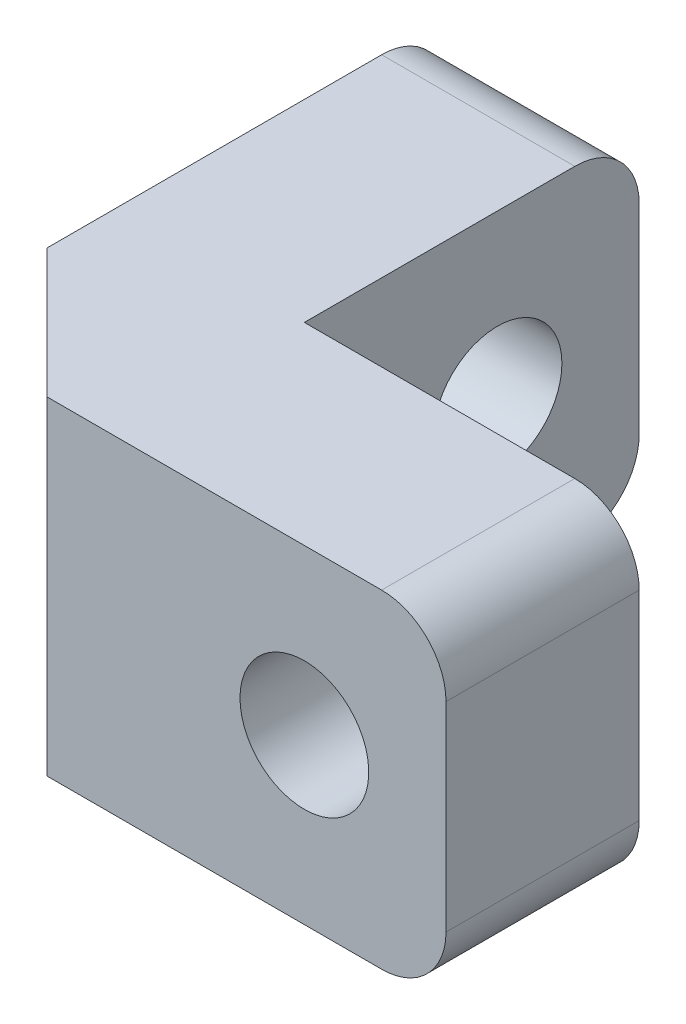
ISO-10303-21;
HEADER;
FILE_DESCRIPTION(('STEP AP214'),'2;1');
FILE_NAME('part.step','',(''),(''),'','','');
FILE_SCHEMA(('AUTOMOTIVE_DESIGN { 1 0 10303 214 1 1 1 1 }'));
ENDSEC;
DATA;
#1=APPLICATION_CONTEXT('core data for automotive mechanical design processes');
#2=APPLICATION_PROTOCOL_DEFINITION('international standard','automotive_design',2000,#1);
#3=PRODUCT_CONTEXT('',#1,'mechanical');
#4=PRODUCT('Part','Part','',(#3));
#5=PRODUCT_RELATED_PRODUCT_CATEGORY('part','',(#4));
#6=PRODUCT_DEFINITION_FORMATION('','',#4);
#7=PRODUCT_DEFINITION_CONTEXT('part definition',#1,'design');
#8=PRODUCT_DEFINITION('design','',#6,#7);
#9=PRODUCT_DEFINITION_SHAPE('','',#8);
#10=(LENGTH_UNIT() NAMED_UNIT(*) SI_UNIT(.MILLI.,.METRE.));
#11=(NAMED_UNIT(*) PLANE_ANGLE_UNIT() SI_UNIT($,.RADIAN.));
#12=(NAMED_UNIT(*) SI_UNIT($,.STERADIAN.) SOLID_ANGLE_UNIT());
#13=UNCERTAINTY_MEASURE_WITH_UNIT(LENGTH_MEASURE(1.E-05),#10,'distance_accuracy_value','');
#14=(GEOMETRIC_REPRESENTATION_CONTEXT(3) GLOBAL_UNCERTAINTY_ASSIGNED_CONTEXT((#13)) GLOBAL_UNIT_ASSIGNED_CONTEXT((#10,
#11,#12)) REPRESENTATION_CONTEXT('',''));
#15=CARTESIAN_POINT('',(0.,0.,0.));
#16=DIRECTION('',(0.,0.,1.));
#17=DIRECTION('',(1.,0.,0.));
#18=AXIS2_PLACEMENT_3D('',#15,#16,#17);
#19=CARTESIAN_POINT('',(-5.1,2.55,-3.));
#20=DIRECTION('',(1.,0.,0.));
#21=DIRECTION('',(0.,0.,-1.));
#22=AXIS2_PLACEMENT_3D('',#19,#20,#21);
#23=CYLINDRICAL_SURFACE('',#22,1.);
#24=CARTESIAN_POINT('',(0.,2.55,-3.));
#25=DIRECTION('',(1.,0.,0.));
#26=DIRECTION('',(0.,0.,-1.));
#27=AXIS2_PLACEMENT_3D('',#24,#25,#26);
#28=CIRCLE('',#27,1.);
#29=CARTESIAN_POINT('',(0.,2.55,-4.));
#30=VERTEX_POINT('',#29);
#31=EDGE_CURVE('E194',#30,#30,#28,.T.);
#32=ORIENTED_EDGE('',*,*,#31,.T.);
#33=EDGE_LOOP('',(#32));
#34=FACE_BOUND('',#33,.T.);
#35=CARTESIAN_POINT('',(-1.6,2.55,-3.));
#36=DIRECTION('',(-1.,0.,0.));
#37=DIRECTION('',(0.,0.,1.));
#38=AXIS2_PLACEMENT_3D('',#35,#36,#37);
#39=CIRCLE('',#38,1.);
#40=CARTESIAN_POINT('',(-1.6,2.55,-2.));
#41=VERTEX_POINT('',#40);
#42=EDGE_CURVE('E40',#41,#41,#39,.F.);
#43=ORIENTED_EDGE('',*,*,#42,.F.);
#44=EDGE_LOOP('',(#43));
#45=FACE_BOUND('',#44,.T.);
#46=ADVANCED_FACE('F36',(#34,#45),#23,.F.);
#47=CARTESIAN_POINT('',(3.,2.55,5.1));
#48=DIRECTION('',(0.,0.,-1.));
#49=DIRECTION('',(-1.,0.,0.));
#50=AXIS2_PLACEMENT_3D('',#47,#48,#49);
#51=CYLINDRICAL_SURFACE('',#50,1.);
#52=CARTESIAN_POINT('',(3.,2.55,3.));
#53=DIRECTION('',(0.,0.,-1.));
#54=DIRECTION('',(-1.,0.,0.));
#55=AXIS2_PLACEMENT_3D('',#52,#53,#54);
#56=CIRCLE('',#55,1.);
#57=CARTESIAN_POINT('',(2.,2.55,3.));
#58=VERTEX_POINT('',#57);
#59=EDGE_CURVE('E192',#58,#58,#56,.T.);
#60=ORIENTED_EDGE('',*,*,#59,.F.);
#61=EDGE_LOOP('',(#60));
#62=FACE_BOUND('',#61,.T.);
#63=CARTESIAN_POINT('',(3.,2.55,1.4));
#64=DIRECTION('',(0.,0.,-1.));
#65=DIRECTION('',(-1.,0.,0.));
#66=AXIS2_PLACEMENT_3D('',#63,#64,#65);
#67=CIRCLE('',#66,1.);
#68=CARTESIAN_POINT('',(2.,2.55,1.4));
#69=VERTEX_POINT('',#68);
#70=EDGE_CURVE('E195',#69,#69,#67,.F.);
#71=ORIENTED_EDGE('',*,*,#70,.F.);
#72=EDGE_LOOP('',(#71));
#73=FACE_BOUND('',#72,.T.);
#74=ADVANCED_FACE('F270',(#62,#73),#51,.F.);
#75=CARTESIAN_POINT('',(0.,5.1,0.));
#76=DIRECTION('',(0.,0.,1.));
#77=DIRECTION('',(1.,0.,0.));
#78=AXIS2_PLACEMENT_3D('',#75,#76,#77);
#79=PLANE('',#78);
#80=CARTESIAN_POINT('',(3.,2.55,0.));
#81=DIRECTION('',(0.,0.,-1.));
#82=DIRECTION('',(-1.,0.,0.));
#83=AXIS2_PLACEMENT_3D('',#80,#81,#82);
#84=CIRCLE('',#83,1.7);
#85=CARTESIAN_POINT('',(1.3,2.55,0.));
#86=VERTEX_POINT('',#85);
#87=EDGE_CURVE('E201',#86,#86,#84,.T.);
#88=ORIENTED_EDGE('',*,*,#87,.F.);
#89=EDGE_LOOP('',(#88));
#90=FACE_BOUND('',#89,.T.);
#91=DIRECTION('',(0.,-1.,0.));
#92=VECTOR('',#91,1.);
#93=CARTESIAN_POINT('',(5.2,5.1,0.));
#94=LINE('',#93,#92);
#95=CARTESIAN_POINT('',(5.2,4.1,0.));
#96=VERTEX_POINT('',#95);
#97=CARTESIAN_POINT('',(5.2,1.,0.));
#98=VERTEX_POINT('',#97);
#99=EDGE_CURVE('E216',#96,#98,#94,.T.);
#100=ORIENTED_EDGE('',*,*,#99,.T.);
#101=CARTESIAN_POINT('',(4.2,1.,0.));
#102=DIRECTION('',(0.,0.,1.));
#103=DIRECTION('',(1.,0.,0.));
#104=AXIS2_PLACEMENT_3D('',#101,#102,#103);
#105=CIRCLE('',#104,1.);
#106=CARTESIAN_POINT('',(4.2,0.,0.));
#107=VERTEX_POINT('',#106);
#108=EDGE_CURVE('E170',#98,#107,#105,.F.);
#109=ORIENTED_EDGE('',*,*,#108,.T.);
#110=DIRECTION('',(-1.,0.,0.));
#111=VECTOR('',#110,1.);
#112=CARTESIAN_POINT('',(0.,0.,0.));
#113=LINE('',#112,#111);
#114=CARTESIAN_POINT('',(0.,0.,0.));
#115=VERTEX_POINT('',#114);
#116=EDGE_CURVE('E144',#107,#115,#113,.T.);
#117=ORIENTED_EDGE('',*,*,#116,.T.);
#118=DIRECTION('',(0.,-1.,0.));
#119=VECTOR('',#118,1.);
#120=CARTESIAN_POINT('',(0.,5.1,0.));
#121=LINE('',#120,#119);
#122=CARTESIAN_POINT('',(0.,5.1,0.));
#123=VERTEX_POINT('',#122);
#124=EDGE_CURVE('E137',#123,#115,#121,.T.);
#125=ORIENTED_EDGE('',*,*,#124,.F.);
#126=DIRECTION('',(-1.,0.,0.));
#127=VECTOR('',#126,1.);
#128=CARTESIAN_POINT('',(0.,5.1,0.));
#129=LINE('',#128,#127);
#130=CARTESIAN_POINT('',(4.2,5.1,0.));
#131=VERTEX_POINT('',#130);
#132=EDGE_CURVE('E122',#131,#123,#129,.T.);
#133=ORIENTED_EDGE('',*,*,#132,.F.);
#134=CARTESIAN_POINT('',(4.2,4.1,0.));
#135=DIRECTION('',(0.,0.,1.));
#136=DIRECTION('',(1.,0.,0.));
#137=AXIS2_PLACEMENT_3D('',#134,#135,#136);
#138=CIRCLE('',#137,1.);
#139=EDGE_CURVE('E168',#131,#96,#138,.F.);
#140=ORIENTED_EDGE('',*,*,#139,.T.);
#141=EDGE_LOOP('',(#100,#109,#117,#125,#133,#140));
#142=FACE_BOUND('',#141,.T.);
#143=ADVANCED_FACE('F142',(#90,#142),#79,.F.);
#144=CARTESIAN_POINT('',(0.,5.1,0.));
#145=DIRECTION('',(-1.,0.,0.));
#146=DIRECTION('',(0.,0.,1.));
#147=AXIS2_PLACEMENT_3D('',#144,#145,#146);
#148=PLANE('',#147);
#149=ORIENTED_EDGE('',*,*,#31,.F.);
#150=EDGE_LOOP('',(#149));
#151=FACE_BOUND('',#150,.T.);
#152=DIRECTION('',(0.,0.,-1.));
#153=VECTOR('',#152,1.);
#154=CARTESIAN_POINT('',(0.,0.,0.));
#155=LINE('',#154,#153);
#156=CARTESIAN_POINT('',(0.,0.,-4.2));
#157=VERTEX_POINT('',#156);
#158=EDGE_CURVE('E218',#115,#157,#155,.T.);
#159=ORIENTED_EDGE('',*,*,#158,.T.);
#160=CARTESIAN_POINT('',(0.,1.,-4.2));
#161=DIRECTION('',(-1.,0.,0.));
#162=DIRECTION('',(0.,0.,1.));
#163=AXIS2_PLACEMENT_3D('',#160,#161,#162);
#164=CIRCLE('',#163,1.);
#165=CARTESIAN_POINT('',(0.,1.,-5.2));
#166=VERTEX_POINT('',#165);
#167=EDGE_CURVE('E11',#157,#166,#164,.F.);
#168=ORIENTED_EDGE('',*,*,#167,.T.);
#169=DIRECTION('',(0.,-1.,0.));
#170=VECTOR('',#169,1.);
#171=CARTESIAN_POINT('',(0.,5.1,-5.2));
#172=LINE('',#171,#170);
#173=CARTESIAN_POINT('',(0.,4.1,-5.2));
#174=VERTEX_POINT('',#173);
#175=EDGE_CURVE('E147',#174,#166,#172,.T.);
#176=ORIENTED_EDGE('',*,*,#175,.F.);
#177=CARTESIAN_POINT('',(0.,4.1,-4.2));
#178=DIRECTION('',(-1.,0.,0.));
#179=DIRECTION('',(0.,0.,1.));
#180=AXIS2_PLACEMENT_3D('',#177,#178,#179);
#181=CIRCLE('',#180,1.);
#182=CARTESIAN_POINT('',(0.,5.1,-4.2));
#183=VERTEX_POINT('',#182);
#184=EDGE_CURVE('E45',#174,#183,#181,.F.);
#185=ORIENTED_EDGE('',*,*,#184,.T.);
#186=DIRECTION('',(0.,0.,-1.));
#187=VECTOR('',#186,1.);
#188=CARTESIAN_POINT('',(0.,5.1,0.));
#189=LINE('',#188,#187);
#190=EDGE_CURVE('E127',#123,#183,#189,.T.);
#191=ORIENTED_EDGE('',*,*,#190,.F.);
#192=ORIENTED_EDGE('',*,*,#124,.T.);
#193=EDGE_LOOP('',(#159,#168,#176,#185,#191,#192));
#194=FACE_BOUND('',#193,.T.);
#195=ADVANCED_FACE('F136',(#151,#194),#148,.F.);
#196=CARTESIAN_POINT('',(0.,5.1,-5.2));
#197=DIRECTION('',(0.,0.,1.));
#198=DIRECTION('',(1.,0.,0.));
#199=AXIS2_PLACEMENT_3D('',#196,#197,#198);
#200=PLANE('',#199);
#201=ORIENTED_EDGE('',*,*,#175,.T.);
#202=DIRECTION('',(-1.,0.,0.));
#203=VECTOR('',#202,1.);
#204=CARTESIAN_POINT('',(0.,1.,-5.2));
#205=LINE('',#204,#203);
#206=CARTESIAN_POINT('',(-3.,1.,-5.2));
#207=VERTEX_POINT('',#206);
#208=EDGE_CURVE('E184',#166,#207,#205,.T.);
#209=ORIENTED_EDGE('',*,*,#208,.T.);
#210=DIRECTION('',(0.,-1.,0.));
#211=VECTOR('',#210,1.);
#212=CARTESIAN_POINT('',(-3.,5.1,-5.2));
#213=LINE('',#212,#211);
#214=CARTESIAN_POINT('',(-3.,4.1,-5.2));
#215=VERTEX_POINT('',#214);
#216=EDGE_CURVE('E152',#215,#207,#213,.T.);
#217=ORIENTED_EDGE('',*,*,#216,.F.);
#218=DIRECTION('',(-1.,0.,0.));
#219=VECTOR('',#218,1.);
#220=CARTESIAN_POINT('',(0.,4.1,-5.2));
#221=LINE('',#220,#219);
#222=EDGE_CURVE('E58',#215,#174,#221,.F.);
#223=ORIENTED_EDGE('',*,*,#222,.T.);
#224=EDGE_LOOP('',(#201,#209,#217,#223));
#225=FACE_BOUND('',#224,.T.);
#226=ADVANCED_FACE('F232',(#225),#200,.F.);
#227=CARTESIAN_POINT('',(-3.,5.1,-5.2));
#228=DIRECTION('',(1.,0.,0.));
#229=DIRECTION('',(0.,0.,-1.));
#230=AXIS2_PLACEMENT_3D('',#227,#228,#229);
#231=PLANE('',#230);
#232=CARTESIAN_POINT('',(-3.,2.55,-3.));
#233=DIRECTION('',(-1.,0.,0.));
#234=DIRECTION('',(0.,0.,1.));
#235=AXIS2_PLACEMENT_3D('',#232,#233,#234);
#236=CIRCLE('',#235,1.7);
#237=CARTESIAN_POINT('',(-3.,2.55,-1.3));
#238=VERTEX_POINT('',#237);
#239=EDGE_CURVE('E208',#238,#238,#236,.T.);
#240=ORIENTED_EDGE('',*,*,#239,.F.);
#241=EDGE_LOOP('',(#240));
#242=FACE_BOUND('',#241,.T.);
#243=ORIENTED_EDGE('',*,*,#216,.T.);
#244=CARTESIAN_POINT('',(-3.,1.,-4.2));
#245=DIRECTION('',(1.,0.,0.));
#246=DIRECTION('',(0.,0.,-1.));
#247=AXIS2_PLACEMENT_3D('',#244,#245,#246);
#248=CIRCLE('',#247,1.);
#249=CARTESIAN_POINT('',(-3.,0.,-4.2));
#250=VERTEX_POINT('',#249);
#251=EDGE_CURVE('E189',#207,#250,#248,.F.);
#252=ORIENTED_EDGE('',*,*,#251,.T.);
#253=DIRECTION('',(0.,0.,1.));
#254=VECTOR('',#253,1.);
#255=CARTESIAN_POINT('',(-3.,0.,-5.2));
#256=LINE('',#255,#254);
#257=CARTESIAN_POINT('',(-3.,0.,0.999999999999991));
#258=VERTEX_POINT('',#257);
#259=EDGE_CURVE('E220',#250,#258,#256,.T.);
#260=ORIENTED_EDGE('',*,*,#259,.T.);
#261=DIRECTION('',(0.,1.,0.));
#262=VECTOR('',#261,1.);
#263=CARTESIAN_POINT('',(-3.,5.1,0.999999999999991));
#264=LINE('',#263,#262);
#265=CARTESIAN_POINT('',(-3.,5.1,0.99999999999999));
#266=VERTEX_POINT('',#265);
#267=EDGE_CURVE('E158',#258,#266,#264,.T.);
#268=ORIENTED_EDGE('',*,*,#267,.T.);
#269=DIRECTION('',(0.,0.,1.));
#270=VECTOR('',#269,1.);
#271=CARTESIAN_POINT('',(-3.,5.1,-5.2));
#272=LINE('',#271,#270);
#273=CARTESIAN_POINT('',(-3.,5.1,-4.2));
#274=VERTEX_POINT('',#273);
#275=EDGE_CURVE('E139',#274,#266,#272,.T.);
#276=ORIENTED_EDGE('',*,*,#275,.F.);
#277=CARTESIAN_POINT('',(-3.,4.1,-4.2));
#278=DIRECTION('',(1.,0.,0.));
#279=DIRECTION('',(0.,0.,-1.));
#280=AXIS2_PLACEMENT_3D('',#277,#278,#279);
#281=CIRCLE('',#280,1.);
#282=EDGE_CURVE('E187',#274,#215,#281,.F.);
#283=ORIENTED_EDGE('',*,*,#282,.T.);
#284=EDGE_LOOP('',(#243,#252,#260,#268,#276,#283));
#285=FACE_BOUND('',#284,.T.);
#286=ADVANCED_FACE('F229',(#242,#285),#231,.F.);
#287=CARTESIAN_POINT('',(-3.,5.1,3.));
#288=DIRECTION('',(0.,0.,-1.));
#289=DIRECTION('',(-1.,0.,0.));
#290=AXIS2_PLACEMENT_3D('',#287,#288,#289);
#291=PLANE('',#290);
#292=ORIENTED_EDGE('',*,*,#59,.T.);
#293=EDGE_LOOP('',(#292));
#294=FACE_BOUND('',#293,.T.);
#295=DIRECTION('',(1.,0.,0.));
#296=VECTOR('',#295,1.);
#297=CARTESIAN_POINT('',(-3.,0.,3.));
#298=LINE('',#297,#296);
#299=CARTESIAN_POINT('',(-0.999999999999998,0.,3.));
#300=VERTEX_POINT('',#299);
#301=CARTESIAN_POINT('',(4.2,0.,3.));
#302=VERTEX_POINT('',#301);
#303=EDGE_CURVE('E133',#300,#302,#298,.T.);
#304=ORIENTED_EDGE('',*,*,#303,.T.);
#305=CARTESIAN_POINT('',(4.2,1.,3.));
#306=DIRECTION('',(0.,0.,-1.));
#307=DIRECTION('',(-1.,0.,0.));
#308=AXIS2_PLACEMENT_3D('',#305,#306,#307);
#309=CIRCLE('',#308,1.);
#310=CARTESIAN_POINT('',(5.2,1.,3.));
#311=VERTEX_POINT('',#310);
#312=EDGE_CURVE('E178',#302,#311,#309,.F.);
#313=ORIENTED_EDGE('',*,*,#312,.T.);
#314=DIRECTION('',(0.,-1.,0.));
#315=VECTOR('',#314,1.);
#316=CARTESIAN_POINT('',(5.2,5.1,3.));
#317=LINE('',#316,#315);
#318=CARTESIAN_POINT('',(5.2,4.1,3.));
#319=VERTEX_POINT('',#318);
#320=EDGE_CURVE('E225',#319,#311,#317,.T.);
#321=ORIENTED_EDGE('',*,*,#320,.F.);
#322=CARTESIAN_POINT('',(4.2,4.1,3.));
#323=DIRECTION('',(0.,0.,-1.));
#324=DIRECTION('',(-1.,0.,0.));
#325=AXIS2_PLACEMENT_3D('',#322,#323,#324);
#326=CIRCLE('',#325,1.);
#327=CARTESIAN_POINT('',(4.2,5.1,3.));
#328=VERTEX_POINT('',#327);
#329=EDGE_CURVE('E176',#319,#328,#326,.F.);
#330=ORIENTED_EDGE('',*,*,#329,.T.);
#331=DIRECTION('',(1.,0.,0.));
#332=VECTOR('',#331,1.);
#333=CARTESIAN_POINT('',(-3.,5.1,3.));
#334=LINE('',#333,#332);
#335=CARTESIAN_POINT('',(-0.999999999999998,5.1,3.));
#336=VERTEX_POINT('',#335);
#337=EDGE_CURVE('E214',#336,#328,#334,.T.);
#338=ORIENTED_EDGE('',*,*,#337,.F.);
#339=DIRECTION('',(0.,-1.,0.));
#340=VECTOR('',#339,1.);
#341=CARTESIAN_POINT('',(-0.999999999999998,5.1,3.));
#342=LINE('',#341,#340);
#343=EDGE_CURVE('E146',#336,#300,#342,.T.);
#344=ORIENTED_EDGE('',*,*,#343,.T.);
#345=EDGE_LOOP('',(#304,#313,#321,#330,#338,#344));
#346=FACE_BOUND('',#345,.T.);
#347=ADVANCED_FACE('F242',(#294,#346),#291,.F.);
#348=CARTESIAN_POINT('',(5.2,5.1,3.));
#349=DIRECTION('',(-1.,0.,0.));
#350=DIRECTION('',(0.,0.,1.));
#351=AXIS2_PLACEMENT_3D('',#348,#349,#350);
#352=PLANE('',#351);
#353=ORIENTED_EDGE('',*,*,#320,.T.);
#354=DIRECTION('',(0.,0.,-1.));
#355=VECTOR('',#354,1.);
#356=CARTESIAN_POINT('',(5.2,1.,3.));
#357=LINE('',#356,#355);
#358=EDGE_CURVE('E165',#311,#98,#357,.T.);
#359=ORIENTED_EDGE('',*,*,#358,.T.);
#360=ORIENTED_EDGE('',*,*,#99,.F.);
#361=DIRECTION('',(0.,0.,-1.));
#362=VECTOR('',#361,1.);
#363=CARTESIAN_POINT('',(5.2,4.1,3.));
#364=LINE('',#363,#362);
#365=EDGE_CURVE('E163',#96,#319,#364,.F.);
#366=ORIENTED_EDGE('',*,*,#365,.T.);
#367=EDGE_LOOP('',(#353,#359,#360,#366));
#368=FACE_BOUND('',#367,.T.);
#369=ADVANCED_FACE('F251',(#368),#352,.F.);
#370=CARTESIAN_POINT('',(0.,5.1,0.));
#371=DIRECTION('',(0.,1.,0.));
#372=DIRECTION('',(0.,0.,1.));
#373=AXIS2_PLACEMENT_3D('',#370,#371,#372);
#374=PLANE('',#373);
#375=ORIENTED_EDGE('',*,*,#337,.T.);
#376=DIRECTION('',(0.,0.,-1.));
#377=VECTOR('',#376,1.);
#378=CARTESIAN_POINT('',(4.2,5.1,0.));
#379=LINE('',#378,#377);
#380=EDGE_CURVE('E130',#328,#131,#379,.T.);
#381=ORIENTED_EDGE('',*,*,#380,.T.);
#382=ORIENTED_EDGE('',*,*,#132,.T.);
#383=ORIENTED_EDGE('',*,*,#190,.T.);
#384=DIRECTION('',(-1.,0.,0.));
#385=VECTOR('',#384,1.);
#386=CARTESIAN_POINT('',(-3.,5.1,-4.2));
#387=LINE('',#386,#385);
#388=EDGE_CURVE('E180',#183,#274,#387,.T.);
#389=ORIENTED_EDGE('',*,*,#388,.T.);
#390=ORIENTED_EDGE('',*,*,#275,.T.);
#391=DIRECTION('',(-0.707106781186546,0.,-0.707106781186549));
#392=VECTOR('',#391,1.);
#393=CARTESIAN_POINT('',(-2.,5.1,1.99999999999999));
#394=LINE('',#393,#392);
#395=EDGE_CURVE('E161',#266,#336,#394,.F.);
#396=ORIENTED_EDGE('',*,*,#395,.T.);
#397=EDGE_LOOP('',(#375,#381,#382,#383,#389,#390,#396));
#398=FACE_BOUND('',#397,.T.);
#399=ADVANCED_FACE('F125',(#398),#374,.T.);
#400=CARTESIAN_POINT('',(0.,0.,0.));
#401=DIRECTION('',(0.,1.,0.));
#402=DIRECTION('',(0.,0.,1.));
#403=AXIS2_PLACEMENT_3D('',#400,#401,#402);
#404=PLANE('',#403);
#405=ORIENTED_EDGE('',*,*,#116,.F.);
#406=DIRECTION('',(0.,0.,-1.));
#407=VECTOR('',#406,1.);
#408=CARTESIAN_POINT('',(4.2,0.,0.));
#409=LINE('',#408,#407);
#410=EDGE_CURVE('E174',#107,#302,#409,.F.);
#411=ORIENTED_EDGE('',*,*,#410,.T.);
#412=ORIENTED_EDGE('',*,*,#303,.F.);
#413=DIRECTION('',(0.707106781186546,0.,0.707106781186549));
#414=VECTOR('',#413,1.);
#415=CARTESIAN_POINT('',(-0.999999999999998,0.,3.));
#416=LINE('',#415,#414);
#417=EDGE_CURVE('E150',#300,#258,#416,.F.);
#418=ORIENTED_EDGE('',*,*,#417,.T.);
#419=ORIENTED_EDGE('',*,*,#259,.F.);
#420=DIRECTION('',(-1.,0.,0.));
#421=VECTOR('',#420,1.);
#422=CARTESIAN_POINT('',(0.,0.,-4.2));
#423=LINE('',#422,#421);
#424=EDGE_CURVE('E172',#250,#157,#423,.F.);
#425=ORIENTED_EDGE('',*,*,#424,.T.);
#426=ORIENTED_EDGE('',*,*,#158,.F.);
#427=EDGE_LOOP('',(#405,#411,#412,#418,#419,#425,#426));
#428=FACE_BOUND('',#427,.T.);
#429=ADVANCED_FACE('F258',(#428),#404,.F.);
#430=CARTESIAN_POINT('',(-0.999999999999998,5.1,3.));
#431=DIRECTION('',(0.707106781186549,0.,-0.707106781186546));
#432=DIRECTION('',(0.,-1.,0.));
#433=AXIS2_PLACEMENT_3D('',#430,#431,#432);
#434=PLANE('',#433);
#435=ORIENTED_EDGE('',*,*,#395,.F.);
#436=ORIENTED_EDGE('',*,*,#267,.F.);
#437=ORIENTED_EDGE('',*,*,#417,.F.);
#438=ORIENTED_EDGE('',*,*,#343,.F.);
#439=EDGE_LOOP('',(#435,#436,#437,#438));
#440=FACE_BOUND('',#439,.T.);
#441=ADVANCED_FACE('F239',(#440),#434,.F.);
#442=CARTESIAN_POINT('',(4.2,1.,3.));
#443=DIRECTION('',(0.,0.,-1.));
#444=DIRECTION('',(-1.,0.,0.));
#445=AXIS2_PLACEMENT_3D('',#442,#443,#444);
#446=CYLINDRICAL_SURFACE('',#445,1.);
#447=ORIENTED_EDGE('',*,*,#312,.F.);
#448=ORIENTED_EDGE('',*,*,#410,.F.);
#449=ORIENTED_EDGE('',*,*,#108,.F.);
#450=ORIENTED_EDGE('',*,*,#358,.F.);
#451=EDGE_LOOP('',(#447,#448,#449,#450));
#452=FACE_BOUND('',#451,.T.);
#453=ADVANCED_FACE('F255',(#452),#446,.T.);
#454=CARTESIAN_POINT('',(4.2,4.1,0.));
#455=DIRECTION('',(0.,0.,1.));
#456=DIRECTION('',(1.,0.,0.));
#457=AXIS2_PLACEMENT_3D('',#454,#455,#456);
#458=CYLINDRICAL_SURFACE('',#457,1.);
#459=ORIENTED_EDGE('',*,*,#329,.F.);
#460=ORIENTED_EDGE('',*,*,#365,.F.);
#461=ORIENTED_EDGE('',*,*,#139,.F.);
#462=ORIENTED_EDGE('',*,*,#380,.F.);
#463=EDGE_LOOP('',(#459,#460,#461,#462));
#464=FACE_BOUND('',#463,.T.);
#465=ADVANCED_FACE('F248',(#464),#458,.T.);
#466=CARTESIAN_POINT('',(0.,1.,-4.2));
#467=DIRECTION('',(-1.,0.,0.));
#468=DIRECTION('',(0.,0.,1.));
#469=AXIS2_PLACEMENT_3D('',#466,#467,#468);
#470=CYLINDRICAL_SURFACE('',#469,1.);
#471=ORIENTED_EDGE('',*,*,#167,.F.);
#472=ORIENTED_EDGE('',*,*,#424,.F.);
#473=ORIENTED_EDGE('',*,*,#251,.F.);
#474=ORIENTED_EDGE('',*,*,#208,.F.);
#475=EDGE_LOOP('',(#471,#472,#473,#474));
#476=FACE_BOUND('',#475,.T.);
#477=ADVANCED_FACE('F261',(#476),#470,.T.);
#478=CARTESIAN_POINT('',(0.,4.1,-4.2));
#479=DIRECTION('',(1.,0.,0.));
#480=DIRECTION('',(0.,0.,-1.));
#481=AXIS2_PLACEMENT_3D('',#478,#479,#480);
#482=CYLINDRICAL_SURFACE('',#481,1.);
#483=ORIENTED_EDGE('',*,*,#184,.F.);
#484=ORIENTED_EDGE('',*,*,#222,.F.);
#485=ORIENTED_EDGE('',*,*,#282,.F.);
#486=ORIENTED_EDGE('',*,*,#388,.F.);
#487=EDGE_LOOP('',(#483,#484,#485,#486));
#488=FACE_BOUND('',#487,.T.);
#489=ADVANCED_FACE('F38',(#488),#482,.T.);
#490=CARTESIAN_POINT('',(3.,2.55,1.4));
#491=DIRECTION('',(0.,0.,-1.));
#492=DIRECTION('',(-1.,0.,0.));
#493=AXIS2_PLACEMENT_3D('',#490,#491,#492);
#494=PLANE('',#493);
#495=CARTESIAN_POINT('',(3.,2.55,1.4));
#496=DIRECTION('',(0.,0.,-1.));
#497=DIRECTION('',(-1.,0.,0.));
#498=AXIS2_PLACEMENT_3D('',#495,#496,#497);
#499=CIRCLE('',#498,1.7);
#500=CARTESIAN_POINT('',(1.3,2.55,1.4));
#501=VERTEX_POINT('',#500);
#502=EDGE_CURVE('E197',#501,#501,#499,.T.);
#503=ORIENTED_EDGE('',*,*,#502,.T.);
#504=EDGE_LOOP('',(#503));
#505=FACE_BOUND('',#504,.T.);
#506=ORIENTED_EDGE('',*,*,#70,.T.);
#507=EDGE_LOOP('',(#506));
#508=FACE_BOUND('',#507,.T.);
#509=ADVANCED_FACE('F267',(#505,#508),#494,.T.);
#510=CARTESIAN_POINT('',(3.,2.55,1.4));
#511=DIRECTION('',(0.,0.,-1.));
#512=DIRECTION('',(-1.,0.,0.));
#513=AXIS2_PLACEMENT_3D('',#510,#511,#512);
#514=CYLINDRICAL_SURFACE('',#513,1.7);
#515=ORIENTED_EDGE('',*,*,#502,.F.);
#516=EDGE_LOOP('',(#515));
#517=FACE_BOUND('',#516,.T.);
#518=ORIENTED_EDGE('',*,*,#87,.T.);
#519=EDGE_LOOP('',(#518));
#520=FACE_BOUND('',#519,.T.);
#521=ADVANCED_FACE('F359',(#517,#520),#514,.F.);
#522=CARTESIAN_POINT('',(-1.6,2.55,-3.));
#523=DIRECTION('',(-1.,0.,0.));
#524=DIRECTION('',(0.,0.,1.));
#525=AXIS2_PLACEMENT_3D('',#522,#523,#524);
#526=PLANE('',#525);
#527=CARTESIAN_POINT('',(-1.6,2.55,-3.));
#528=DIRECTION('',(-1.,0.,0.));
#529=DIRECTION('',(0.,0.,1.));
#530=AXIS2_PLACEMENT_3D('',#527,#528,#529);
#531=CIRCLE('',#530,1.7);
#532=CARTESIAN_POINT('',(-1.6,2.55,-1.3));
#533=VERTEX_POINT('',#532);
#534=EDGE_CURVE('E403',#533,#533,#531,.T.);
#535=ORIENTED_EDGE('',*,*,#534,.T.);
#536=EDGE_LOOP('',(#535));
#537=FACE_BOUND('',#536,.T.);
#538=ORIENTED_EDGE('',*,*,#42,.T.);
#539=EDGE_LOOP('',(#538));
#540=FACE_BOUND('',#539,.T.);
#541=ADVANCED_FACE('F367',(#537,#540),#526,.T.);
#542=CARTESIAN_POINT('',(-1.6,2.55,-3.));
#543=DIRECTION('',(-1.,0.,0.));
#544=DIRECTION('',(0.,0.,1.));
#545=AXIS2_PLACEMENT_3D('',#542,#543,#544);
#546=CYLINDRICAL_SURFACE('',#545,1.7);
#547=ORIENTED_EDGE('',*,*,#534,.F.);
#548=EDGE_LOOP('',(#547));
#549=FACE_BOUND('',#548,.T.);
#550=ORIENTED_EDGE('',*,*,#239,.T.);
#551=EDGE_LOOP('',(#550));
#552=FACE_BOUND('',#551,.T.);
#553=ADVANCED_FACE('F386',(#549,#552),#546,.F.);
#554=CLOSED_SHELL('',(#46,#74,#143,#195,#226,#286,#347,#369,#399,#429,#441,#453,#465,#477,#489,
#509,#521,#541,#553));
#555=MANIFOLD_SOLID_BREP('B2',#554);
#556=ADVANCED_BREP_SHAPE_REPRESENTATION('',(#18,#555),#14);
#557=SHAPE_DEFINITION_REPRESENTATION(#9,#556);
ENDSEC;
END-ISO-10303-21;
